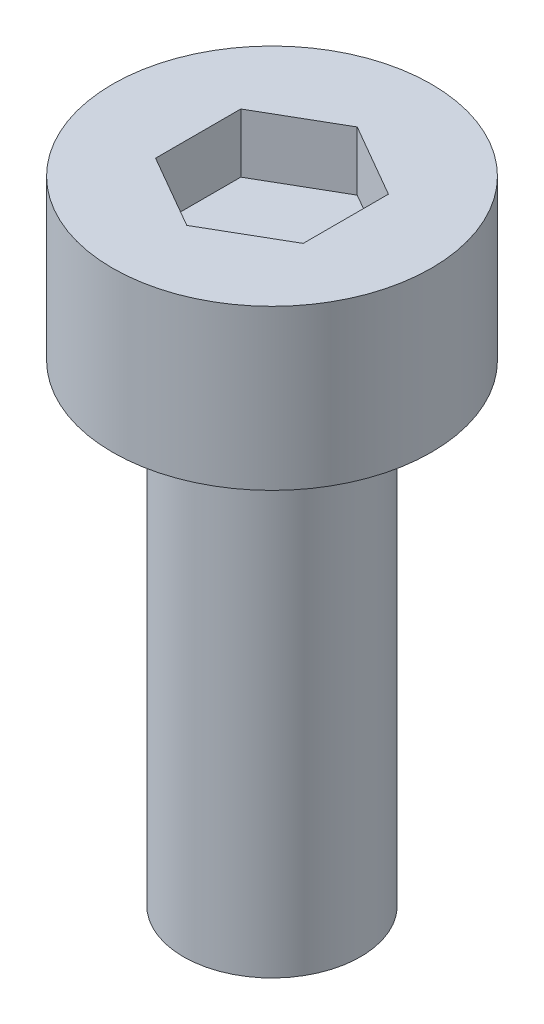
ISO-10303-21;
HEADER;
FILE_DESCRIPTION(('STEP AP214'),'2;1');
FILE_NAME('part.step','',(''),(''),'','','');
FILE_SCHEMA(('AUTOMOTIVE_DESIGN { 1 0 10303 214 1 1 1 1 }'));
ENDSEC;
DATA;
#1=APPLICATION_CONTEXT('core data for automotive mechanical design processes');
#2=APPLICATION_PROTOCOL_DEFINITION('international standard','automotive_design',2000,#1);
#3=PRODUCT_CONTEXT('',#1,'mechanical');
#4=PRODUCT('Part','Part','',(#3));
#5=PRODUCT_RELATED_PRODUCT_CATEGORY('part','',(#4));
#6=PRODUCT_DEFINITION_FORMATION('','',#4);
#7=PRODUCT_DEFINITION_CONTEXT('part definition',#1,'design');
#8=PRODUCT_DEFINITION('design','',#6,#7);
#9=PRODUCT_DEFINITION_SHAPE('','',#8);
#10=(LENGTH_UNIT() NAMED_UNIT(*) SI_UNIT(.MILLI.,.METRE.));
#11=(NAMED_UNIT(*) PLANE_ANGLE_UNIT() SI_UNIT($,.RADIAN.));
#12=(NAMED_UNIT(*) SI_UNIT($,.STERADIAN.) SOLID_ANGLE_UNIT());
#13=UNCERTAINTY_MEASURE_WITH_UNIT(LENGTH_MEASURE(1.E-05),#10,'distance_accuracy_value','');
#14=(GEOMETRIC_REPRESENTATION_CONTEXT(3) GLOBAL_UNCERTAINTY_ASSIGNED_CONTEXT((#13)) GLOBAL_UNIT_ASSIGNED_CONTEXT((#10,
#11,#12)) REPRESENTATION_CONTEXT('',''));
#15=CARTESIAN_POINT('',(0.,0.,0.));
#16=DIRECTION('',(0.,0.,1.));
#17=DIRECTION('',(1.,0.,0.));
#18=AXIS2_PLACEMENT_3D('',#15,#16,#17);
#19=CARTESIAN_POINT('',(0.,2.7,0.));
#20=DIRECTION('',(0.,-1.,0.));
#21=DIRECTION('',(0.,0.,-1.));
#22=AXIS2_PLACEMENT_3D('',#19,#20,#21);
#23=CYLINDRICAL_SURFACE('',#22,2.7);
#24=CARTESIAN_POINT('',(0.,2.7,0.));
#25=DIRECTION('',(0.,1.,0.));
#26=DIRECTION('',(0.,0.,1.));
#27=AXIS2_PLACEMENT_3D('',#24,#25,#26);
#28=CIRCLE('',#27,2.7);
#29=CARTESIAN_POINT('',(0.,2.7,2.7));
#30=VERTEX_POINT('',#29);
#31=EDGE_CURVE('E44',#30,#30,#28,.T.);
#32=ORIENTED_EDGE('',*,*,#31,.F.);
#33=EDGE_LOOP('',(#32));
#34=FACE_BOUND('',#33,.T.);
#35=CARTESIAN_POINT('',(0.,0.,0.));
#36=DIRECTION('',(0.,1.,0.));
#37=DIRECTION('',(0.,0.,1.));
#38=AXIS2_PLACEMENT_3D('',#35,#36,#37);
#39=CIRCLE('',#38,2.7);
#40=CARTESIAN_POINT('',(0.,0.,2.7));
#41=VERTEX_POINT('',#40);
#42=EDGE_CURVE('E39',#41,#41,#39,.T.);
#43=ORIENTED_EDGE('',*,*,#42,.T.);
#44=EDGE_LOOP('',(#43));
#45=FACE_BOUND('',#44,.T.);
#46=ADVANCED_FACE('F36',(#34,#45),#23,.T.);
#47=CARTESIAN_POINT('',(0.,2.7,0.));
#48=DIRECTION('',(0.,1.,0.));
#49=DIRECTION('',(0.,0.,1.));
#50=AXIS2_PLACEMENT_3D('',#47,#48,#49);
#51=PLANE('',#50);
#52=DIRECTION('',(-0.866025403784439,0.,-0.5));
#53=VECTOR('',#52,1.);
#54=CARTESIAN_POINT('',(1.25,2.7,-0.721687836487033));
#55=LINE('',#54,#53);
#56=CARTESIAN_POINT('',(1.25,2.7,-0.721687836487033));
#57=VERTEX_POINT('',#56);
#58=CARTESIAN_POINT('',(0.,2.7,-1.44337567297407));
#59=VERTEX_POINT('',#58);
#60=EDGE_CURVE('E52',#57,#59,#55,.T.);
#61=ORIENTED_EDGE('',*,*,#60,.F.);
#62=DIRECTION('',(0.,0.,-1.));
#63=VECTOR('',#62,1.);
#64=CARTESIAN_POINT('',(1.25,2.7,0.721687836487031));
#65=LINE('',#64,#63);
#66=CARTESIAN_POINT('',(1.25,2.7,0.721687836487031));
#67=VERTEX_POINT('',#66);
#68=EDGE_CURVE('E136',#67,#57,#65,.T.);
#69=ORIENTED_EDGE('',*,*,#68,.F.);
#70=DIRECTION('',(0.866025403784439,0.,-0.5));
#71=VECTOR('',#70,1.);
#72=CARTESIAN_POINT('',(0.,2.7,1.44337567297406));
#73=LINE('',#72,#71);
#74=CARTESIAN_POINT('',(0.,2.7,1.44337567297406));
#75=VERTEX_POINT('',#74);
#76=EDGE_CURVE('E134',#75,#67,#73,.T.);
#77=ORIENTED_EDGE('',*,*,#76,.F.);
#78=DIRECTION('',(0.866025403784438,0.,0.5));
#79=VECTOR('',#78,1.);
#80=CARTESIAN_POINT('',(-1.25,2.7,0.721687836487032));
#81=LINE('',#80,#79);
#82=CARTESIAN_POINT('',(-1.25,2.7,0.721687836487032));
#83=VERTEX_POINT('',#82);
#84=EDGE_CURVE('E100',#83,#75,#81,.T.);
#85=ORIENTED_EDGE('',*,*,#84,.F.);
#86=DIRECTION('',(0.,0.,1.));
#87=VECTOR('',#86,1.);
#88=CARTESIAN_POINT('',(-1.25,2.7,-0.721687836487032));
#89=LINE('',#88,#87);
#90=CARTESIAN_POINT('',(-1.25,2.7,-0.721687836487032));
#91=VERTEX_POINT('',#90);
#92=EDGE_CURVE('E130',#91,#83,#89,.T.);
#93=ORIENTED_EDGE('',*,*,#92,.F.);
#94=DIRECTION('',(-0.866025403784439,0.,0.5));
#95=VECTOR('',#94,1.);
#96=CARTESIAN_POINT('',(0.,2.7,-1.44337567297407));
#97=LINE('',#96,#95);
#98=EDGE_CURVE('E126',#59,#91,#97,.T.);
#99=ORIENTED_EDGE('',*,*,#98,.F.);
#100=EDGE_LOOP('',(#61,#69,#77,#85,#93,#99));
#101=FACE_BOUND('',#100,.T.);
#102=ORIENTED_EDGE('',*,*,#31,.T.);
#103=EDGE_LOOP('',(#102));
#104=FACE_BOUND('',#103,.T.);
#105=ADVANCED_FACE('F154',(#101,#104),#51,.T.);
#106=CARTESIAN_POINT('',(0.,0.,0.));
#107=DIRECTION('',(0.,1.,0.));
#108=DIRECTION('',(0.,0.,1.));
#109=AXIS2_PLACEMENT_3D('',#106,#107,#108);
#110=PLANE('',#109);
#111=CARTESIAN_POINT('',(0.,0.,0.));
#112=DIRECTION('',(0.,-1.,0.));
#113=DIRECTION('',(0.,0.,-1.));
#114=AXIS2_PLACEMENT_3D('',#111,#112,#113);
#115=CIRCLE('',#114,1.5);
#116=CARTESIAN_POINT('',(0.,0.,-1.5));
#117=VERTEX_POINT('',#116);
#118=EDGE_CURVE('E11',#117,#117,#115,.T.);
#119=ORIENTED_EDGE('',*,*,#118,.F.);
#120=EDGE_LOOP('',(#119));
#121=FACE_BOUND('',#120,.T.);
#122=ORIENTED_EDGE('',*,*,#42,.F.);
#123=EDGE_LOOP('',(#122));
#124=FACE_BOUND('',#123,.T.);
#125=ADVANCED_FACE('F151',(#121,#124),#110,.F.);
#126=CARTESIAN_POINT('',(1.25,1.7,-0.721687836487033));
#127=DIRECTION('',(0.5,0.,-0.866025403784439));
#128=DIRECTION('',(-0.866025403784439,0.,-0.5));
#129=AXIS2_PLACEMENT_3D('',#126,#127,#128);
#130=PLANE('',#129);
#131=ORIENTED_EDGE('',*,*,#60,.T.);
#132=DIRECTION('',(0.,1.,0.));
#133=VECTOR('',#132,1.);
#134=CARTESIAN_POINT('',(0.,1.7,-1.44337567297407));
#135=LINE('',#134,#133);
#136=CARTESIAN_POINT('',(0.,1.7,-1.44337567297407));
#137=VERTEX_POINT('',#136);
#138=EDGE_CURVE('E82',#137,#59,#135,.T.);
#139=ORIENTED_EDGE('',*,*,#138,.F.);
#140=DIRECTION('',(-0.866025403784439,0.,-0.5));
#141=VECTOR('',#140,1.);
#142=CARTESIAN_POINT('',(1.25,1.7,-0.721687836487033));
#143=LINE('',#142,#141);
#144=CARTESIAN_POINT('',(1.25,1.7,-0.721687836487033));
#145=VERTEX_POINT('',#144);
#146=EDGE_CURVE('E138',#145,#137,#143,.T.);
#147=ORIENTED_EDGE('',*,*,#146,.F.);
#148=DIRECTION('',(0.,1.,0.));
#149=VECTOR('',#148,1.);
#150=CARTESIAN_POINT('',(1.25,1.7,-0.721687836487033));
#151=LINE('',#150,#149);
#152=EDGE_CURVE('E60',#145,#57,#151,.T.);
#153=ORIENTED_EDGE('',*,*,#152,.T.);
#154=EDGE_LOOP('',(#131,#139,#147,#153));
#155=FACE_BOUND('',#154,.T.);
#156=ADVANCED_FACE('F153',(#155),#130,.F.);
#157=CARTESIAN_POINT('',(1.25,1.7,0.721687836487031));
#158=DIRECTION('',(1.,0.,0.));
#159=DIRECTION('',(0.,0.,-1.));
#160=AXIS2_PLACEMENT_3D('',#157,#158,#159);
#161=PLANE('',#160);
#162=ORIENTED_EDGE('',*,*,#68,.T.);
#163=ORIENTED_EDGE('',*,*,#152,.F.);
#164=DIRECTION('',(0.,0.,-1.));
#165=VECTOR('',#164,1.);
#166=CARTESIAN_POINT('',(1.25,1.7,0.721687836487031));
#167=LINE('',#166,#165);
#168=CARTESIAN_POINT('',(1.25,1.7,0.721687836487031));
#169=VERTEX_POINT('',#168);
#170=EDGE_CURVE('E112',#169,#145,#167,.T.);
#171=ORIENTED_EDGE('',*,*,#170,.F.);
#172=DIRECTION('',(0.,1.,0.));
#173=VECTOR('',#172,1.);
#174=CARTESIAN_POINT('',(1.25,1.7,0.721687836487031));
#175=LINE('',#174,#173);
#176=EDGE_CURVE('E104',#169,#67,#175,.T.);
#177=ORIENTED_EDGE('',*,*,#176,.T.);
#178=EDGE_LOOP('',(#162,#163,#171,#177));
#179=FACE_BOUND('',#178,.T.);
#180=ADVANCED_FACE('F160',(#179),#161,.F.);
#181=CARTESIAN_POINT('',(0.,1.7,1.44337567297406));
#182=DIRECTION('',(0.5,0.,0.866025403784439));
#183=DIRECTION('',(0.866025403784439,0.,-0.5));
#184=AXIS2_PLACEMENT_3D('',#181,#182,#183);
#185=PLANE('',#184);
#186=ORIENTED_EDGE('',*,*,#76,.T.);
#187=ORIENTED_EDGE('',*,*,#176,.F.);
#188=DIRECTION('',(0.866025403784439,0.,-0.5));
#189=VECTOR('',#188,1.);
#190=CARTESIAN_POINT('',(0.,1.7,1.44337567297406));
#191=LINE('',#190,#189);
#192=CARTESIAN_POINT('',(0.,1.7,1.44337567297406));
#193=VERTEX_POINT('',#192);
#194=EDGE_CURVE('E108',#193,#169,#191,.T.);
#195=ORIENTED_EDGE('',*,*,#194,.F.);
#196=DIRECTION('',(0.,1.,0.));
#197=VECTOR('',#196,1.);
#198=CARTESIAN_POINT('',(0.,1.7,1.44337567297406));
#199=LINE('',#198,#197);
#200=EDGE_CURVE('E93',#193,#75,#199,.T.);
#201=ORIENTED_EDGE('',*,*,#200,.T.);
#202=EDGE_LOOP('',(#186,#187,#195,#201));
#203=FACE_BOUND('',#202,.T.);
#204=ADVANCED_FACE('F109',(#203),#185,.F.);
#205=CARTESIAN_POINT('',(-1.25,1.7,0.721687836487032));
#206=DIRECTION('',(-0.5,0.,0.866025403784438));
#207=DIRECTION('',(0.866025403784438,0.,0.5));
#208=AXIS2_PLACEMENT_3D('',#205,#206,#207);
#209=PLANE('',#208);
#210=ORIENTED_EDGE('',*,*,#84,.T.);
#211=ORIENTED_EDGE('',*,*,#200,.F.);
#212=DIRECTION('',(0.866025403784438,0.,0.5));
#213=VECTOR('',#212,1.);
#214=CARTESIAN_POINT('',(-1.25,1.7,0.721687836487032));
#215=LINE('',#214,#213);
#216=CARTESIAN_POINT('',(-1.25,1.7,0.721687836487032));
#217=VERTEX_POINT('',#216);
#218=EDGE_CURVE('E97',#217,#193,#215,.T.);
#219=ORIENTED_EDGE('',*,*,#218,.F.);
#220=DIRECTION('',(0.,1.,0.));
#221=VECTOR('',#220,1.);
#222=CARTESIAN_POINT('',(-1.25,1.7,0.721687836487032));
#223=LINE('',#222,#221);
#224=EDGE_CURVE('E105',#217,#83,#223,.T.);
#225=ORIENTED_EDGE('',*,*,#224,.T.);
#226=EDGE_LOOP('',(#210,#211,#219,#225));
#227=FACE_BOUND('',#226,.T.);
#228=ADVANCED_FACE('F95',(#227),#209,.F.);
#229=CARTESIAN_POINT('',(-1.25,1.7,-0.721687836487032));
#230=DIRECTION('',(-1.,0.,0.));
#231=DIRECTION('',(0.,0.,1.));
#232=AXIS2_PLACEMENT_3D('',#229,#230,#231);
#233=PLANE('',#232);
#234=ORIENTED_EDGE('',*,*,#92,.T.);
#235=ORIENTED_EDGE('',*,*,#224,.F.);
#236=DIRECTION('',(0.,0.,1.));
#237=VECTOR('',#236,1.);
#238=CARTESIAN_POINT('',(-1.25,1.7,-0.721687836487032));
#239=LINE('',#238,#237);
#240=CARTESIAN_POINT('',(-1.25,1.7,-0.721687836487032));
#241=VERTEX_POINT('',#240);
#242=EDGE_CURVE('E118',#241,#217,#239,.T.);
#243=ORIENTED_EDGE('',*,*,#242,.F.);
#244=DIRECTION('',(0.,1.,0.));
#245=VECTOR('',#244,1.);
#246=CARTESIAN_POINT('',(-1.25,1.7,-0.721687836487032));
#247=LINE('',#246,#245);
#248=EDGE_CURVE('E142',#241,#91,#247,.T.);
#249=ORIENTED_EDGE('',*,*,#248,.T.);
#250=EDGE_LOOP('',(#234,#235,#243,#249));
#251=FACE_BOUND('',#250,.T.);
#252=ADVANCED_FACE('F209',(#251),#233,.F.);
#253=CARTESIAN_POINT('',(0.,1.7,-1.44337567297407));
#254=DIRECTION('',(-0.5,0.,-0.866025403784439));
#255=DIRECTION('',(-0.866025403784439,0.,0.5));
#256=AXIS2_PLACEMENT_3D('',#253,#254,#255);
#257=PLANE('',#256);
#258=ORIENTED_EDGE('',*,*,#98,.T.);
#259=ORIENTED_EDGE('',*,*,#248,.F.);
#260=DIRECTION('',(-0.866025403784439,0.,0.5));
#261=VECTOR('',#260,1.);
#262=CARTESIAN_POINT('',(0.,1.7,-1.44337567297407));
#263=LINE('',#262,#261);
#264=EDGE_CURVE('E120',#137,#241,#263,.T.);
#265=ORIENTED_EDGE('',*,*,#264,.F.);
#266=ORIENTED_EDGE('',*,*,#138,.T.);
#267=EDGE_LOOP('',(#258,#259,#265,#266));
#268=FACE_BOUND('',#267,.T.);
#269=ADVANCED_FACE('F219',(#268),#257,.F.);
#270=CARTESIAN_POINT('',(0.,1.7,0.));
#271=DIRECTION('',(0.,1.,0.));
#272=DIRECTION('',(0.,0.,1.));
#273=AXIS2_PLACEMENT_3D('',#270,#271,#272);
#274=PLANE('',#273);
#275=ORIENTED_EDGE('',*,*,#146,.T.);
#276=ORIENTED_EDGE('',*,*,#264,.T.);
#277=ORIENTED_EDGE('',*,*,#242,.T.);
#278=ORIENTED_EDGE('',*,*,#218,.T.);
#279=ORIENTED_EDGE('',*,*,#194,.T.);
#280=ORIENTED_EDGE('',*,*,#170,.T.);
#281=EDGE_LOOP('',(#275,#276,#277,#278,#279,#280));
#282=FACE_BOUND('',#281,.T.);
#283=ADVANCED_FACE('F115',(#282),#274,.T.);
#284=CARTESIAN_POINT('',(0.,-8.,0.));
#285=DIRECTION('',(0.,1.,0.));
#286=DIRECTION('',(0.,0.,1.));
#287=AXIS2_PLACEMENT_3D('',#284,#285,#286);
#288=CYLINDRICAL_SURFACE('',#287,1.5);
#289=CARTESIAN_POINT('',(0.,-8.,0.));
#290=DIRECTION('',(0.,-1.,0.));
#291=DIRECTION('',(0.,0.,-1.));
#292=AXIS2_PLACEMENT_3D('',#289,#290,#291);
#293=CIRCLE('',#292,1.5);
#294=CARTESIAN_POINT('',(0.,-8.,-1.5));
#295=VERTEX_POINT('',#294);
#296=EDGE_CURVE('E127',#295,#295,#293,.T.);
#297=ORIENTED_EDGE('',*,*,#296,.F.);
#298=EDGE_LOOP('',(#297));
#299=FACE_BOUND('',#298,.T.);
#300=ORIENTED_EDGE('',*,*,#118,.T.);
#301=EDGE_LOOP('',(#300));
#302=FACE_BOUND('',#301,.T.);
#303=ADVANCED_FACE('F239',(#299,#302),#288,.T.);
#304=CARTESIAN_POINT('',(0.,-8.,0.));
#305=DIRECTION('',(0.,-1.,0.));
#306=DIRECTION('',(0.,0.,-1.));
#307=AXIS2_PLACEMENT_3D('',#304,#305,#306);
#308=PLANE('',#307);
#309=ORIENTED_EDGE('',*,*,#296,.T.);
#310=EDGE_LOOP('',(#309));
#311=FACE_BOUND('',#310,.T.);
#312=ADVANCED_FACE('F254',(#311),#308,.T.);
#313=CLOSED_SHELL('',(#46,#105,#125,#156,#180,#204,#228,#252,#269,#283,#303,#312));
#314=MANIFOLD_SOLID_BREP('B2',#313);
#315=ADVANCED_BREP_SHAPE_REPRESENTATION('',(#18,#314),#14);
#316=SHAPE_DEFINITION_REPRESENTATION(#9,#315);
ENDSEC;
END-ISO-10303-21;
